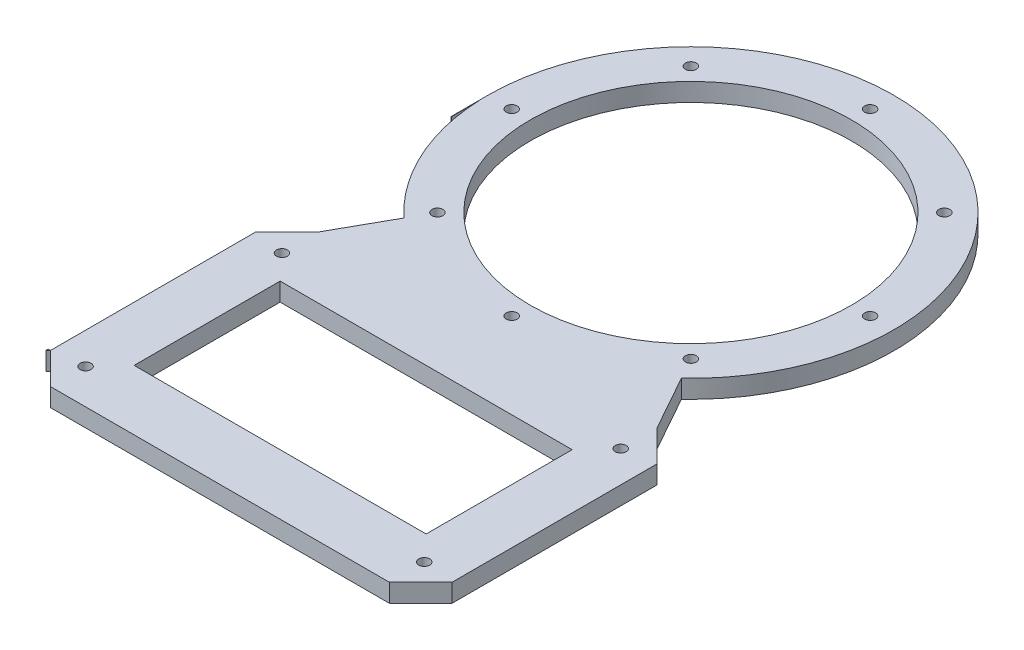
ISO-10303-21;
HEADER;
FILE_DESCRIPTION(('STEP AP214'),'2;1');
FILE_NAME('part.step','',(''),(''),'','','');
FILE_SCHEMA(('AUTOMOTIVE_DESIGN { 1 0 10303 214 1 1 1 1 }'));
ENDSEC;
DATA;
#1=APPLICATION_CONTEXT('core data for automotive mechanical design processes');
#2=APPLICATION_PROTOCOL_DEFINITION('international standard','automotive_design',2000,#1);
#3=PRODUCT_CONTEXT('',#1,'mechanical');
#4=PRODUCT('Part','Part','',(#3));
#5=PRODUCT_RELATED_PRODUCT_CATEGORY('part','',(#4));
#6=PRODUCT_DEFINITION_FORMATION('','',#4);
#7=PRODUCT_DEFINITION_CONTEXT('part definition',#1,'design');
#8=PRODUCT_DEFINITION('design','',#6,#7);
#9=PRODUCT_DEFINITION_SHAPE('','',#8);
#10=(LENGTH_UNIT() NAMED_UNIT(*) SI_UNIT(.MILLI.,.METRE.));
#11=(NAMED_UNIT(*) PLANE_ANGLE_UNIT() SI_UNIT($,.RADIAN.));
#12=(NAMED_UNIT(*) SI_UNIT($,.STERADIAN.) SOLID_ANGLE_UNIT());
#13=UNCERTAINTY_MEASURE_WITH_UNIT(LENGTH_MEASURE(1.E-05),#10,'distance_accuracy_value','');
#14=(GEOMETRIC_REPRESENTATION_CONTEXT(3) GLOBAL_UNCERTAINTY_ASSIGNED_CONTEXT((#13)) GLOBAL_UNIT_ASSIGNED_CONTEXT((#10,
#11,#12)) REPRESENTATION_CONTEXT('',''));
#15=CARTESIAN_POINT('',(0.,0.,0.));
#16=DIRECTION('',(0.,0.,1.));
#17=DIRECTION('',(1.,0.,0.));
#18=AXIS2_PLACEMENT_3D('',#15,#16,#17);
#19=CARTESIAN_POINT('',(0.,5.,0.));
#20=DIRECTION('',(0.,1.,0.));
#21=DIRECTION('',(0.,0.,1.));
#22=AXIS2_PLACEMENT_3D('',#19,#20,#21);
#23=PLANE('',#22);
#24=DIRECTION('',(-1.,0.,0.));
#25=VECTOR('',#24,1.);
#26=CARTESIAN_POINT('',(-55.,5.,10.100208009947));
#27=LINE('',#26,#25);
#28=CARTESIAN_POINT('',(-55.5231153531416,5.,10.100208009947));
#29=VERTEX_POINT('',#28);
#30=CARTESIAN_POINT('',(-55.6267813796967,5.,10.100208009947));
#31=VERTEX_POINT('',#30);
#32=EDGE_CURVE('E286',#29,#31,#27,.T.);
#33=ORIENTED_EDGE('',*,*,#32,.F.);
#34=DIRECTION('',(-0.00966358614296542,0.,-0.999953306461286));
#35=VECTOR('',#34,1.);
#36=CARTESIAN_POINT('',(-55.6155300054044,5.,0.537470561496375));
#37=LINE('',#36,#35);
#38=CARTESIAN_POINT('',(-55.6042786311121,5.,1.70172250269174));
#39=VERTEX_POINT('',#38);
#40=EDGE_CURVE('E300',#29,#39,#37,.T.);
#41=ORIENTED_EDGE('',*,*,#40,.T.);
#42=CARTESIAN_POINT('',(0.,5.,0.));
#43=DIRECTION('',(0.,1.,0.));
#44=DIRECTION('',(0.,0.,1.));
#45=AXIS2_PLACEMENT_3D('',#42,#43,#44);
#46=CIRCLE('',#45,55.6303124345218);
#47=CARTESIAN_POINT('',(-38.0133988234325,5.,40.6166612543814));
#48=VERTEX_POINT('',#47);
#49=EDGE_CURVE('E312',#39,#48,#46,.T.);
#50=ORIENTED_EDGE('',*,*,#49,.T.);
#51=DIRECTION('',(0.487671562378733,0.,-0.873027174403572));
#52=VECTOR('',#51,1.);
#53=CARTESIAN_POINT('',(-11.6803523639078,5.,-6.52462586898569));
#54=LINE('',#53,#52);
#55=CARTESIAN_POINT('',(-46.4,5.,55.6303124345218));
#56=VERTEX_POINT('',#55);
#57=EDGE_CURVE('E373',#56,#48,#54,.T.);
#58=ORIENTED_EDGE('',*,*,#57,.F.);
#59=DIRECTION('',(-0.707106781186541,0.,0.707106781186554));
#60=VECTOR('',#59,1.);
#61=CARTESIAN_POINT('',(4.6151562172605,5.,4.61515621726042));
#62=LINE('',#61,#60);
#63=CARTESIAN_POINT('',(-55.,5.,64.230312434522));
#64=VERTEX_POINT('',#63);
#65=EDGE_CURVE('E315',#56,#64,#62,.T.);
#66=ORIENTED_EDGE('',*,*,#65,.T.);
#67=DIRECTION('',(0.,0.,-1.));
#68=VECTOR('',#67,1.);
#69=CARTESIAN_POINT('',(-55.,5.,120.419438856063));
#70=LINE('',#69,#68);
#71=CARTESIAN_POINT('',(-55.,5.,120.419438856063));
#72=VERTEX_POINT('',#71);
#73=EDGE_CURVE('E169',#72,#64,#70,.T.);
#74=ORIENTED_EDGE('',*,*,#73,.F.);
#75=DIRECTION('',(-0.707106781186551,0.,-0.707106781186544));
#76=VECTOR('',#75,1.);
#77=CARTESIAN_POINT('',(-87.7097194280314,5.,87.7097194280323));
#78=LINE('',#77,#76);
#79=CARTESIAN_POINT('',(-46.4,5.,129.019438856063));
#80=VERTEX_POINT('',#79);
#81=EDGE_CURVE('E333',#80,#72,#78,.T.);
#82=ORIENTED_EDGE('',*,*,#81,.F.);
#83=DIRECTION('',(1.,0.,0.));
#84=VECTOR('',#83,1.);
#85=CARTESIAN_POINT('',(0.,5.,129.019438856063));
#86=LINE('',#85,#84);
#87=CARTESIAN_POINT('',(46.4,5.,129.019438856063));
#88=VERTEX_POINT('',#87);
#89=EDGE_CURVE('E363',#80,#88,#86,.T.);
#90=ORIENTED_EDGE('',*,*,#89,.T.);
#91=DIRECTION('',(0.707106781186546,0.,-0.707106781186549));
#92=VECTOR('',#91,1.);
#93=CARTESIAN_POINT('',(87.7097194280317,5.,87.7097194280314));
#94=LINE('',#93,#92);
#95=CARTESIAN_POINT('',(55.,5.,120.419438856063));
#96=VERTEX_POINT('',#95);
#97=EDGE_CURVE('E344',#88,#96,#94,.T.);
#98=ORIENTED_EDGE('',*,*,#97,.T.);
#99=DIRECTION('',(0.,0.,1.));
#100=VECTOR('',#99,1.);
#101=CARTESIAN_POINT('',(55.,5.,0.));
#102=LINE('',#101,#100);
#103=CARTESIAN_POINT('',(55.,5.,64.2303124345216));
#104=VERTEX_POINT('',#103);
#105=EDGE_CURVE('E356',#104,#96,#102,.T.);
#106=ORIENTED_EDGE('',*,*,#105,.F.);
#107=DIRECTION('',(0.707106781186556,0.,0.707106781186539));
#108=VECTOR('',#107,1.);
#109=CARTESIAN_POINT('',(-4.61515621726145,5.,4.61515621726156));
#110=LINE('',#109,#108);
#111=CARTESIAN_POINT('',(46.4,5.,55.6303124345218));
#112=VERTEX_POINT('',#111);
#113=EDGE_CURVE('E350',#112,#104,#110,.T.);
#114=ORIENTED_EDGE('',*,*,#113,.F.);
#115=DIRECTION('',(-0.48767156237877,0.,-0.873027174403552));
#116=VECTOR('',#115,1.);
#117=CARTESIAN_POINT('',(11.6803523639049,5.,-6.52462586898473));
#118=LINE('',#117,#116);
#119=CARTESIAN_POINT('',(38.013398823432,5.,40.6166612543819));
#120=VERTEX_POINT('',#119);
#121=EDGE_CURVE('E341',#112,#120,#118,.T.);
#122=ORIENTED_EDGE('',*,*,#121,.T.);
#123=CARTESIAN_POINT('',(-55.6267813796967,5.,-0.626781379698214));
#124=VERTEX_POINT('',#123);
#125=EDGE_CURVE('E317',#120,#124,#46,.T.);
#126=ORIENTED_EDGE('',*,*,#125,.T.);
#127=DIRECTION('',(0.,0.,1.));
#128=VECTOR('',#127,1.);
#129=CARTESIAN_POINT('',(-55.6267813796967,5.,0.));
#130=LINE('',#129,#128);
#131=EDGE_CURVE('E303',#124,#31,#130,.T.);
#132=ORIENTED_EDGE('',*,*,#131,.T.);
#133=EDGE_LOOP('',(#33,#41,#50,#58,#66,#74,#82,#90,#98,#106,#114,#122,#126,#132));
#134=FACE_BOUND('',#133,.T.);
#135=DIRECTION('',(0.,0.,-1.));
#136=VECTOR('',#135,1.);
#137=CARTESIAN_POINT('',(-40.,5.,0.));
#138=LINE('',#137,#136);
#139=CARTESIAN_POINT('',(-40.,5.,112.530312434522));
#140=VERTEX_POINT('',#139);
#141=CARTESIAN_POINT('',(-40.,5.,72.5303124345218));
#142=VERTEX_POINT('',#141);
#143=EDGE_CURVE('E335',#140,#142,#138,.T.);
#144=ORIENTED_EDGE('',*,*,#143,.T.);
#145=DIRECTION('',(1.,0.,0.));
#146=VECTOR('',#145,1.);
#147=CARTESIAN_POINT('',(0.,5.,72.5303124345218));
#148=LINE('',#147,#146);
#149=CARTESIAN_POINT('',(40.,5.,72.5303124345218));
#150=VERTEX_POINT('',#149);
#151=EDGE_CURVE('E339',#142,#150,#148,.T.);
#152=ORIENTED_EDGE('',*,*,#151,.T.);
#153=DIRECTION('',(0.,0.,1.));
#154=VECTOR('',#153,1.);
#155=CARTESIAN_POINT('',(40.,5.,0.));
#156=LINE('',#155,#154);
#157=CARTESIAN_POINT('',(40.,5.,112.530312434522));
#158=VERTEX_POINT('',#157);
#159=EDGE_CURVE('E457',#150,#158,#156,.T.);
#160=ORIENTED_EDGE('',*,*,#159,.T.);
#161=DIRECTION('',(-1.,0.,0.));
#162=VECTOR('',#161,1.);
#163=CARTESIAN_POINT('',(0.,5.,112.530312434522));
#164=LINE('',#163,#162);
#165=EDGE_CURVE('E454',#158,#140,#164,.T.);
#166=ORIENTED_EDGE('',*,*,#165,.T.);
#167=EDGE_LOOP('',(#144,#152,#160,#166));
#168=FACE_BOUND('',#167,.T.);
#169=CARTESIAN_POINT('',(46.4,5.,65.6303124345218));
#170=DIRECTION('',(0.,1.,0.));
#171=DIRECTION('',(0.,0.,1.));
#172=AXIS2_PLACEMENT_3D('',#169,#170,#171);
#173=CIRCLE('',#172,1.5);
#174=CARTESIAN_POINT('',(46.4,5.,67.1303124345218));
#175=VERTEX_POINT('',#174);
#176=EDGE_CURVE('E462',#175,#175,#173,.T.);
#177=ORIENTED_EDGE('',*,*,#176,.F.);
#178=EDGE_LOOP('',(#177));
#179=FACE_BOUND('',#178,.T.);
#180=CARTESIAN_POINT('',(0.,5.,0.));
#181=DIRECTION('',(0.,1.,0.));
#182=DIRECTION('',(0.,0.,1.));
#183=AXIS2_PLACEMENT_3D('',#180,#181,#182);
#184=CIRCLE('',#183,44.);
#185=CARTESIAN_POINT('',(0.,5.,44.));
#186=VERTEX_POINT('',#185);
#187=EDGE_CURVE('E466',#186,#186,#184,.T.);
#188=ORIENTED_EDGE('',*,*,#187,.F.);
#189=EDGE_LOOP('',(#188));
#190=FACE_BOUND('',#189,.T.);
#191=CARTESIAN_POINT('',(-49.1,5.,0.));
#192=DIRECTION('',(0.,1.,0.));
#193=DIRECTION('',(0.,0.,1.));
#194=AXIS2_PLACEMENT_3D('',#191,#192,#193);
#195=CIRCLE('',#194,1.5);
#196=CARTESIAN_POINT('',(-49.1,5.,1.5));
#197=VERTEX_POINT('',#196);
#198=EDGE_CURVE('E471',#197,#197,#195,.T.);
#199=ORIENTED_EDGE('',*,*,#198,.F.);
#200=EDGE_LOOP('',(#199));
#201=FACE_BOUND('',#200,.T.);
#202=CARTESIAN_POINT('',(-34.7189429562594,5.,-34.7189429562595));
#203=DIRECTION('',(0.,1.,0.));
#204=DIRECTION('',(0.,0.,1.));
#205=AXIS2_PLACEMENT_3D('',#202,#203,#204);
#206=CIRCLE('',#205,1.50000000000001);
#207=CARTESIAN_POINT('',(-34.7189429562594,5.,-33.2189429562595));
#208=VERTEX_POINT('',#207);
#209=EDGE_CURVE('E475',#208,#208,#206,.T.);
#210=ORIENTED_EDGE('',*,*,#209,.F.);
#211=EDGE_LOOP('',(#210));
#212=FACE_BOUND('',#211,.T.);
#213=CARTESIAN_POINT('',(1.71431733737198E-13,5.,-49.1));
#214=DIRECTION('',(0.,1.,0.));
#215=DIRECTION('',(0.,0.,1.));
#216=AXIS2_PLACEMENT_3D('',#213,#214,#215);
#217=CIRCLE('',#216,1.5);
#218=CARTESIAN_POINT('',(1.71431733737198E-13,5.,-47.6));
#219=VERTEX_POINT('',#218);
#220=EDGE_CURVE('E479',#219,#219,#217,.T.);
#221=ORIENTED_EDGE('',*,*,#220,.F.);
#222=EDGE_LOOP('',(#221));
#223=FACE_BOUND('',#222,.T.);
#224=CARTESIAN_POINT('',(34.7189429562597,5.,-34.7189429562593));
#225=DIRECTION('',(0.,1.,0.));
#226=DIRECTION('',(0.,0.,1.));
#227=AXIS2_PLACEMENT_3D('',#224,#225,#226);
#228=CIRCLE('',#227,1.50000000000001);
#229=CARTESIAN_POINT('',(34.7189429562597,5.,-33.2189429562593));
#230=VERTEX_POINT('',#229);
#231=EDGE_CURVE('E483',#230,#230,#228,.T.);
#232=ORIENTED_EDGE('',*,*,#231,.F.);
#233=EDGE_LOOP('',(#232));
#234=FACE_BOUND('',#233,.T.);
#235=CARTESIAN_POINT('',(49.1,5.,3.42863467474396E-13));
#236=DIRECTION('',(0.,1.,0.));
#237=DIRECTION('',(0.,0.,1.));
#238=AXIS2_PLACEMENT_3D('',#235,#236,#237);
#239=CIRCLE('',#238,1.5);
#240=CARTESIAN_POINT('',(49.1,5.,1.50000000000034));
#241=VERTEX_POINT('',#240);
#242=EDGE_CURVE('E487',#241,#241,#239,.T.);
#243=ORIENTED_EDGE('',*,*,#242,.F.);
#244=EDGE_LOOP('',(#243));
#245=FACE_BOUND('',#244,.T.);
#246=CARTESIAN_POINT('',(34.7189429562592,5.,34.7189429562598));
#247=DIRECTION('',(0.,1.,0.));
#248=DIRECTION('',(0.,0.,1.));
#249=AXIS2_PLACEMENT_3D('',#246,#247,#248);
#250=CIRCLE('',#249,1.50000000000001);
#251=CARTESIAN_POINT('',(34.7189429562592,5.,36.2189429562598));
#252=VERTEX_POINT('',#251);
#253=EDGE_CURVE('E491',#252,#252,#250,.T.);
#254=ORIENTED_EDGE('',*,*,#253,.F.);
#255=EDGE_LOOP('',(#254));
#256=FACE_BOUND('',#255,.T.);
#257=CARTESIAN_POINT('',(-5.14295201211594E-13,5.,49.1));
#258=DIRECTION('',(0.,1.,0.));
#259=DIRECTION('',(0.,0.,1.));
#260=AXIS2_PLACEMENT_3D('',#257,#258,#259);
#261=CIRCLE('',#260,1.50000000000001);
#262=CARTESIAN_POINT('',(-5.14295201211594E-13,5.,50.6));
#263=VERTEX_POINT('',#262);
#264=EDGE_CURVE('E419',#263,#263,#261,.T.);
#265=ORIENTED_EDGE('',*,*,#264,.F.);
#266=EDGE_LOOP('',(#265));
#267=FACE_BOUND('',#266,.T.);
#268=CARTESIAN_POINT('',(-34.7189429562599,5.,34.7189429562591));
#269=DIRECTION('',(0.,1.,0.));
#270=DIRECTION('',(0.,0.,1.));
#271=AXIS2_PLACEMENT_3D('',#268,#269,#270);
#272=CIRCLE('',#271,1.5);
#273=CARTESIAN_POINT('',(-34.7189429562599,5.,36.218942956259));
#274=VERTEX_POINT('',#273);
#275=EDGE_CURVE('E347',#274,#274,#272,.T.);
#276=ORIENTED_EDGE('',*,*,#275,.F.);
#277=EDGE_LOOP('',(#276));
#278=FACE_BOUND('',#277,.T.);
#279=CARTESIAN_POINT('',(-46.4,5.,65.6303124345218));
#280=DIRECTION('',(0.,1.,0.));
#281=DIRECTION('',(0.,0.,1.));
#282=AXIS2_PLACEMENT_3D('',#279,#280,#281);
#283=CIRCLE('',#282,1.5);
#284=CARTESIAN_POINT('',(-46.4,5.,67.1303124345218));
#285=VERTEX_POINT('',#284);
#286=EDGE_CURVE('E379',#285,#285,#283,.T.);
#287=ORIENTED_EDGE('',*,*,#286,.F.);
#288=EDGE_LOOP('',(#287));
#289=FACE_BOUND('',#288,.T.);
#290=CARTESIAN_POINT('',(-46.4,5.,119.430312434522));
#291=DIRECTION('',(0.,1.,0.));
#292=DIRECTION('',(0.,0.,1.));
#293=AXIS2_PLACEMENT_3D('',#290,#291,#292);
#294=CIRCLE('',#293,1.5);
#295=CARTESIAN_POINT('',(-46.4,5.,120.930312434522));
#296=VERTEX_POINT('',#295);
#297=EDGE_CURVE('E383',#296,#296,#294,.T.);
#298=ORIENTED_EDGE('',*,*,#297,.F.);
#299=EDGE_LOOP('',(#298));
#300=FACE_BOUND('',#299,.T.);
#301=CARTESIAN_POINT('',(46.4,5.,119.430312434522));
#302=DIRECTION('',(0.,1.,0.));
#303=DIRECTION('',(0.,0.,1.));
#304=AXIS2_PLACEMENT_3D('',#301,#302,#303);
#305=CIRCLE('',#304,1.5);
#306=CARTESIAN_POINT('',(46.4,5.,120.930312434522));
#307=VERTEX_POINT('',#306);
#308=EDGE_CURVE('E388',#307,#307,#305,.T.);
#309=ORIENTED_EDGE('',*,*,#308,.F.);
#310=EDGE_LOOP('',(#309));
#311=FACE_BOUND('',#310,.T.);
#312=ADVANCED_FACE('F159',(#134,#168,#179,#190,#201,#212,#223,#234,#245,#256,#267,#278,#289,
#300,#311),#23,.T.);
#313=CARTESIAN_POINT('',(0.,0.,0.));
#314=DIRECTION('',(0.,1.,0.));
#315=DIRECTION('',(0.,0.,1.));
#316=AXIS2_PLACEMENT_3D('',#313,#314,#315);
#317=PLANE('',#316);
#318=CARTESIAN_POINT('',(46.4,0.,119.430312434522));
#319=DIRECTION('',(0.,1.,0.));
#320=DIRECTION('',(0.,0.,1.));
#321=AXIS2_PLACEMENT_3D('',#318,#319,#320);
#322=CIRCLE('',#321,1.5);
#323=CARTESIAN_POINT('',(46.4,0.,120.930312434522));
#324=VERTEX_POINT('',#323);
#325=EDGE_CURVE('E450',#324,#324,#322,.T.);
#326=ORIENTED_EDGE('',*,*,#325,.T.);
#327=EDGE_LOOP('',(#326));
#328=FACE_BOUND('',#327,.T.);
#329=CARTESIAN_POINT('',(-46.4,0.,119.430312434522));
#330=DIRECTION('',(0.,1.,0.));
#331=DIRECTION('',(0.,0.,1.));
#332=AXIS2_PLACEMENT_3D('',#329,#330,#331);
#333=CIRCLE('',#332,1.5);
#334=CARTESIAN_POINT('',(-46.4,0.,120.930312434522));
#335=VERTEX_POINT('',#334);
#336=EDGE_CURVE('E446',#335,#335,#333,.T.);
#337=ORIENTED_EDGE('',*,*,#336,.T.);
#338=EDGE_LOOP('',(#337));
#339=FACE_BOUND('',#338,.T.);
#340=CARTESIAN_POINT('',(-46.4,0.,65.6303124345218));
#341=DIRECTION('',(0.,1.,0.));
#342=DIRECTION('',(0.,0.,1.));
#343=AXIS2_PLACEMENT_3D('',#340,#341,#342);
#344=CIRCLE('',#343,1.5);
#345=CARTESIAN_POINT('',(-46.4,0.,67.1303124345218));
#346=VERTEX_POINT('',#345);
#347=EDGE_CURVE('E441',#346,#346,#344,.T.);
#348=ORIENTED_EDGE('',*,*,#347,.T.);
#349=EDGE_LOOP('',(#348));
#350=FACE_BOUND('',#349,.T.);
#351=CARTESIAN_POINT('',(-34.7189429562599,0.,34.7189429562591));
#352=DIRECTION('',(0.,1.,0.));
#353=DIRECTION('',(0.,0.,1.));
#354=AXIS2_PLACEMENT_3D('',#351,#352,#353);
#355=CIRCLE('',#354,1.5);
#356=CARTESIAN_POINT('',(-34.7189429562599,0.,36.218942956259));
#357=VERTEX_POINT('',#356);
#358=EDGE_CURVE('E445',#357,#357,#355,.T.);
#359=ORIENTED_EDGE('',*,*,#358,.T.);
#360=EDGE_LOOP('',(#359));
#361=FACE_BOUND('',#360,.T.);
#362=CARTESIAN_POINT('',(-5.14295201211594E-13,0.,49.1));
#363=DIRECTION('',(0.,1.,0.));
#364=DIRECTION('',(0.,0.,1.));
#365=AXIS2_PLACEMENT_3D('',#362,#363,#364);
#366=CIRCLE('',#365,1.50000000000001);
#367=CARTESIAN_POINT('',(-5.14295201211594E-13,0.,50.6));
#368=VERTEX_POINT('',#367);
#369=EDGE_CURVE('E532',#368,#368,#366,.T.);
#370=ORIENTED_EDGE('',*,*,#369,.T.);
#371=EDGE_LOOP('',(#370));
#372=FACE_BOUND('',#371,.T.);
#373=CARTESIAN_POINT('',(34.7189429562592,0.,34.7189429562598));
#374=DIRECTION('',(0.,1.,0.));
#375=DIRECTION('',(0.,0.,1.));
#376=AXIS2_PLACEMENT_3D('',#373,#374,#375);
#377=CIRCLE('',#376,1.50000000000001);
#378=CARTESIAN_POINT('',(34.7189429562592,0.,36.2189429562598));
#379=VERTEX_POINT('',#378);
#380=EDGE_CURVE('E536',#379,#379,#377,.T.);
#381=ORIENTED_EDGE('',*,*,#380,.T.);
#382=EDGE_LOOP('',(#381));
#383=FACE_BOUND('',#382,.T.);
#384=CARTESIAN_POINT('',(49.1,0.,3.42863467474396E-13));
#385=DIRECTION('',(0.,1.,0.));
#386=DIRECTION('',(0.,0.,1.));
#387=AXIS2_PLACEMENT_3D('',#384,#385,#386);
#388=CIRCLE('',#387,1.5);
#389=CARTESIAN_POINT('',(49.1,0.,1.50000000000034));
#390=VERTEX_POINT('',#389);
#391=EDGE_CURVE('E540',#390,#390,#388,.T.);
#392=ORIENTED_EDGE('',*,*,#391,.T.);
#393=EDGE_LOOP('',(#392));
#394=FACE_BOUND('',#393,.T.);
#395=CARTESIAN_POINT('',(34.7189429562597,0.,-34.7189429562593));
#396=DIRECTION('',(0.,1.,0.));
#397=DIRECTION('',(0.,0.,1.));
#398=AXIS2_PLACEMENT_3D('',#395,#396,#397);
#399=CIRCLE('',#398,1.50000000000001);
#400=CARTESIAN_POINT('',(34.7189429562597,0.,-33.2189429562593));
#401=VERTEX_POINT('',#400);
#402=EDGE_CURVE('E544',#401,#401,#399,.T.);
#403=ORIENTED_EDGE('',*,*,#402,.T.);
#404=EDGE_LOOP('',(#403));
#405=FACE_BOUND('',#404,.T.);
#406=CARTESIAN_POINT('',(1.71431733737198E-13,0.,-49.1));
#407=DIRECTION('',(0.,1.,0.));
#408=DIRECTION('',(0.,0.,1.));
#409=AXIS2_PLACEMENT_3D('',#406,#407,#408);
#410=CIRCLE('',#409,1.5);
#411=CARTESIAN_POINT('',(1.71431733737198E-13,0.,-47.6));
#412=VERTEX_POINT('',#411);
#413=EDGE_CURVE('E548',#412,#412,#410,.T.);
#414=ORIENTED_EDGE('',*,*,#413,.T.);
#415=EDGE_LOOP('',(#414));
#416=FACE_BOUND('',#415,.T.);
#417=CARTESIAN_POINT('',(-34.7189429562594,0.,-34.7189429562595));
#418=DIRECTION('',(0.,1.,0.));
#419=DIRECTION('',(0.,0.,1.));
#420=AXIS2_PLACEMENT_3D('',#417,#418,#419);
#421=CIRCLE('',#420,1.50000000000001);
#422=CARTESIAN_POINT('',(-34.7189429562594,0.,-33.2189429562595));
#423=VERTEX_POINT('',#422);
#424=EDGE_CURVE('E552',#423,#423,#421,.T.);
#425=ORIENTED_EDGE('',*,*,#424,.T.);
#426=EDGE_LOOP('',(#425));
#427=FACE_BOUND('',#426,.T.);
#428=CARTESIAN_POINT('',(-49.1,0.,0.));
#429=DIRECTION('',(0.,1.,0.));
#430=DIRECTION('',(0.,0.,1.));
#431=AXIS2_PLACEMENT_3D('',#428,#429,#430);
#432=CIRCLE('',#431,1.5);
#433=CARTESIAN_POINT('',(-49.1,0.,1.5));
#434=VERTEX_POINT('',#433);
#435=EDGE_CURVE('E556',#434,#434,#432,.T.);
#436=ORIENTED_EDGE('',*,*,#435,.T.);
#437=EDGE_LOOP('',(#436));
#438=FACE_BOUND('',#437,.T.);
#439=CARTESIAN_POINT('',(0.,0.,0.));
#440=DIRECTION('',(0.,1.,0.));
#441=DIRECTION('',(0.,0.,1.));
#442=AXIS2_PLACEMENT_3D('',#439,#440,#441);
#443=CIRCLE('',#442,44.);
#444=CARTESIAN_POINT('',(0.,0.,44.));
#445=VERTEX_POINT('',#444);
#446=EDGE_CURVE('E560',#445,#445,#443,.T.);
#447=ORIENTED_EDGE('',*,*,#446,.T.);
#448=EDGE_LOOP('',(#447));
#449=FACE_BOUND('',#448,.T.);
#450=CARTESIAN_POINT('',(46.4,0.,65.6303124345218));
#451=DIRECTION('',(0.,1.,0.));
#452=DIRECTION('',(0.,0.,1.));
#453=AXIS2_PLACEMENT_3D('',#450,#451,#452);
#454=CIRCLE('',#453,1.5);
#455=CARTESIAN_POINT('',(46.4,0.,67.1303124345218));
#456=VERTEX_POINT('',#455);
#457=EDGE_CURVE('E328',#456,#456,#454,.T.);
#458=ORIENTED_EDGE('',*,*,#457,.T.);
#459=EDGE_LOOP('',(#458));
#460=FACE_BOUND('',#459,.T.);
#461=DIRECTION('',(0.,0.,-1.));
#462=VECTOR('',#461,1.);
#463=CARTESIAN_POINT('',(-40.,0.,0.));
#464=LINE('',#463,#462);
#465=CARTESIAN_POINT('',(-40.,0.,112.530312434522));
#466=VERTEX_POINT('',#465);
#467=CARTESIAN_POINT('',(-40.,0.,72.5303124345218));
#468=VERTEX_POINT('',#467);
#469=EDGE_CURVE('E423',#466,#468,#464,.T.);
#470=ORIENTED_EDGE('',*,*,#469,.F.);
#471=DIRECTION('',(-1.,0.,0.));
#472=VECTOR('',#471,1.);
#473=CARTESIAN_POINT('',(0.,0.,112.530312434522));
#474=LINE('',#473,#472);
#475=CARTESIAN_POINT('',(40.,0.,112.530312434522));
#476=VERTEX_POINT('',#475);
#477=EDGE_CURVE('E392',#476,#466,#474,.T.);
#478=ORIENTED_EDGE('',*,*,#477,.F.);
#479=DIRECTION('',(0.,0.,1.));
#480=VECTOR('',#479,1.);
#481=CARTESIAN_POINT('',(40.,0.,0.));
#482=LINE('',#481,#480);
#483=CARTESIAN_POINT('',(40.,0.,72.5303124345218));
#484=VERTEX_POINT('',#483);
#485=EDGE_CURVE('E587',#484,#476,#482,.T.);
#486=ORIENTED_EDGE('',*,*,#485,.F.);
#487=DIRECTION('',(1.,0.,0.));
#488=VECTOR('',#487,1.);
#489=CARTESIAN_POINT('',(0.,0.,72.5303124345218));
#490=LINE('',#489,#488);
#491=EDGE_CURVE('E567',#468,#484,#490,.T.);
#492=ORIENTED_EDGE('',*,*,#491,.F.);
#493=EDGE_LOOP('',(#470,#478,#486,#492));
#494=FACE_BOUND('',#493,.T.);
#495=DIRECTION('',(-0.00966358614296542,0.,-0.999953306461286));
#496=VECTOR('',#495,1.);
#497=CARTESIAN_POINT('',(-55.6155300054044,0.,0.537470561496375));
#498=LINE('',#497,#496);
#499=CARTESIAN_POINT('',(-55.5231153531416,0.,10.100208009947));
#500=VERTEX_POINT('',#499);
#501=CARTESIAN_POINT('',(-55.6042786311121,0.,1.70172250269174));
#502=VERTEX_POINT('',#501);
#503=EDGE_CURVE('E294',#500,#502,#498,.T.);
#504=ORIENTED_EDGE('',*,*,#503,.F.);
#505=DIRECTION('',(-1.,0.,0.));
#506=VECTOR('',#505,1.);
#507=CARTESIAN_POINT('',(0.,0.,10.100208009947));
#508=LINE('',#507,#506);
#509=CARTESIAN_POINT('',(-55.6267813796967,0.,10.100208009947));
#510=VERTEX_POINT('',#509);
#511=EDGE_CURVE('E289',#500,#510,#508,.T.);
#512=ORIENTED_EDGE('',*,*,#511,.T.);
#513=DIRECTION('',(0.,0.,1.));
#514=VECTOR('',#513,1.);
#515=CARTESIAN_POINT('',(-55.6267813796967,0.,0.));
#516=LINE('',#515,#514);
#517=CARTESIAN_POINT('',(-55.6267813796967,0.,-0.626781379698214));
#518=VERTEX_POINT('',#517);
#519=EDGE_CURVE('E162',#518,#510,#516,.T.);
#520=ORIENTED_EDGE('',*,*,#519,.F.);
#521=CARTESIAN_POINT('',(0.,0.,0.));
#522=DIRECTION('',(0.,1.,0.));
#523=DIRECTION('',(0.,0.,1.));
#524=AXIS2_PLACEMENT_3D('',#521,#522,#523);
#525=CIRCLE('',#524,55.6303124345218);
#526=CARTESIAN_POINT('',(38.013398823432,0.,40.6166612543819));
#527=VERTEX_POINT('',#526);
#528=EDGE_CURVE('E406',#527,#518,#525,.T.);
#529=ORIENTED_EDGE('',*,*,#528,.F.);
#530=DIRECTION('',(-0.48767156237877,0.,-0.873027174403552));
#531=VECTOR('',#530,1.);
#532=CARTESIAN_POINT('',(11.6803523639049,0.,-6.52462586898473));
#533=LINE('',#532,#531);
#534=CARTESIAN_POINT('',(46.4,0.,55.6303124345218));
#535=VERTEX_POINT('',#534);
#536=EDGE_CURVE('E626',#535,#527,#533,.T.);
#537=ORIENTED_EDGE('',*,*,#536,.F.);
#538=DIRECTION('',(0.707106781186556,0.,0.707106781186539));
#539=VECTOR('',#538,1.);
#540=CARTESIAN_POINT('',(-4.61515621726145,0.,4.61515621726156));
#541=LINE('',#540,#539);
#542=CARTESIAN_POINT('',(55.,0.,64.2303124345216));
#543=VERTEX_POINT('',#542);
#544=EDGE_CURVE('E327',#535,#543,#541,.T.);
#545=ORIENTED_EDGE('',*,*,#544,.T.);
#546=DIRECTION('',(0.,0.,1.));
#547=VECTOR('',#546,1.);
#548=CARTESIAN_POINT('',(55.,0.,0.));
#549=LINE('',#548,#547);
#550=CARTESIAN_POINT('',(55.,0.,120.419438856063));
#551=VERTEX_POINT('',#550);
#552=EDGE_CURVE('E611',#543,#551,#549,.T.);
#553=ORIENTED_EDGE('',*,*,#552,.T.);
#554=DIRECTION('',(0.707106781186546,0.,-0.707106781186549));
#555=VECTOR('',#554,1.);
#556=CARTESIAN_POINT('',(87.7097194280317,0.,87.7097194280314));
#557=LINE('',#556,#555);
#558=CARTESIAN_POINT('',(46.4,0.,129.019438856063));
#559=VERTEX_POINT('',#558);
#560=EDGE_CURVE('E623',#559,#551,#557,.T.);
#561=ORIENTED_EDGE('',*,*,#560,.F.);
#562=DIRECTION('',(1.,0.,0.));
#563=VECTOR('',#562,1.);
#564=CARTESIAN_POINT('',(0.,0.,129.019438856063));
#565=LINE('',#564,#563);
#566=CARTESIAN_POINT('',(-46.4,0.,129.019438856063));
#567=VERTEX_POINT('',#566);
#568=EDGE_CURVE('E332',#567,#559,#565,.T.);
#569=ORIENTED_EDGE('',*,*,#568,.F.);
#570=DIRECTION('',(-0.707106781186551,0.,-0.707106781186544));
#571=VECTOR('',#570,1.);
#572=CARTESIAN_POINT('',(-87.7097194280314,0.,87.7097194280323));
#573=LINE('',#572,#571);
#574=CARTESIAN_POINT('',(-55.,0.,120.419438856063));
#575=VERTEX_POINT('',#574);
#576=EDGE_CURVE('E323',#567,#575,#573,.T.);
#577=ORIENTED_EDGE('',*,*,#576,.T.);
#578=DIRECTION('',(0.,0.,-1.));
#579=VECTOR('',#578,1.);
#580=CARTESIAN_POINT('',(-55.,0.,0.));
#581=LINE('',#580,#579);
#582=CARTESIAN_POINT('',(-55.,0.,64.230312434522));
#583=VERTEX_POINT('',#582);
#584=EDGE_CURVE('E176',#575,#583,#581,.T.);
#585=ORIENTED_EDGE('',*,*,#584,.T.);
#586=DIRECTION('',(-0.707106781186541,0.,0.707106781186554));
#587=VECTOR('',#586,1.);
#588=CARTESIAN_POINT('',(4.6151562172605,0.,4.61515621726042));
#589=LINE('',#588,#587);
#590=CARTESIAN_POINT('',(-46.4,0.,55.6303124345218));
#591=VERTEX_POINT('',#590);
#592=EDGE_CURVE('E439',#591,#583,#589,.T.);
#593=ORIENTED_EDGE('',*,*,#592,.F.);
#594=DIRECTION('',(0.487671562378733,0.,-0.873027174403572));
#595=VECTOR('',#594,1.);
#596=CARTESIAN_POINT('',(-11.6803523639078,0.,-6.52462586898569));
#597=LINE('',#596,#595);
#598=CARTESIAN_POINT('',(-38.0133988234325,0.,40.6166612543814));
#599=VERTEX_POINT('',#598);
#600=EDGE_CURVE('E322',#591,#599,#597,.T.);
#601=ORIENTED_EDGE('',*,*,#600,.T.);
#602=EDGE_CURVE('E414',#502,#599,#525,.T.);
#603=ORIENTED_EDGE('',*,*,#602,.F.);
#604=EDGE_LOOP('',(#504,#512,#520,#529,#537,#545,#553,#561,#569,#577,#585,#593,#601,#603));
#605=FACE_BOUND('',#604,.T.);
#606=ADVANCED_FACE('F404',(#328,#339,#350,#361,#372,#383,#394,#405,#416,#427,#438,#449,#460,
#494,#605),#317,.F.);
#607=CARTESIAN_POINT('',(0.,5.,0.));
#608=DIRECTION('',(0.,-1.,0.));
#609=DIRECTION('',(0.,0.,-1.));
#610=AXIS2_PLACEMENT_3D('',#607,#608,#609);
#611=CYLINDRICAL_SURFACE('',#610,55.6303124345218);
#612=DIRECTION('',(0.,-1.,0.));
#613=VECTOR('',#612,1.);
#614=CARTESIAN_POINT('',(-55.6042786311121,5.,1.70172250269099));
#615=LINE('',#614,#613);
#616=EDGE_CURVE('E309',#502,#39,#615,.F.);
#617=ORIENTED_EDGE('',*,*,#616,.F.);
#618=ORIENTED_EDGE('',*,*,#602,.T.);
#619=DIRECTION('',(0.,-1.,0.));
#620=VECTOR('',#619,1.);
#621=CARTESIAN_POINT('',(-38.0133988234325,5.,40.6166612543814));
#622=LINE('',#621,#620);
#623=EDGE_CURVE('E377',#48,#599,#622,.T.);
#624=ORIENTED_EDGE('',*,*,#623,.F.);
#625=ORIENTED_EDGE('',*,*,#49,.F.);
#626=EDGE_LOOP('',(#617,#618,#624,#625));
#627=FACE_BOUND('',#626,.T.);
#628=ADVANCED_FACE('F521',(#627),#611,.T.);
#629=CARTESIAN_POINT('',(-40.,5.,0.));
#630=DIRECTION('',(-1.,0.,0.));
#631=DIRECTION('',(0.,0.,1.));
#632=AXIS2_PLACEMENT_3D('',#629,#630,#631);
#633=PLANE('',#632);
#634=ORIENTED_EDGE('',*,*,#469,.T.);
#635=DIRECTION('',(0.,-1.,0.));
#636=VECTOR('',#635,1.);
#637=CARTESIAN_POINT('',(-40.,5.,72.5303124345218));
#638=LINE('',#637,#636);
#639=EDGE_CURVE('E574',#142,#468,#638,.T.);
#640=ORIENTED_EDGE('',*,*,#639,.F.);
#641=ORIENTED_EDGE('',*,*,#143,.F.);
#642=DIRECTION('',(0.,-1.,0.));
#643=VECTOR('',#642,1.);
#644=CARTESIAN_POINT('',(-40.,5.,112.530312434522));
#645=LINE('',#644,#643);
#646=EDGE_CURVE('E431',#140,#466,#645,.T.);
#647=ORIENTED_EDGE('',*,*,#646,.T.);
#648=EDGE_LOOP('',(#634,#640,#641,#647));
#649=FACE_BOUND('',#648,.T.);
#650=ADVANCED_FACE('F572',(#649),#633,.F.);
#651=CARTESIAN_POINT('',(0.,5.,72.5303124345218));
#652=DIRECTION('',(0.,0.,-1.));
#653=DIRECTION('',(-1.,0.,0.));
#654=AXIS2_PLACEMENT_3D('',#651,#652,#653);
#655=PLANE('',#654);
#656=ORIENTED_EDGE('',*,*,#491,.T.);
#657=DIRECTION('',(0.,-1.,0.));
#658=VECTOR('',#657,1.);
#659=CARTESIAN_POINT('',(40.,5.,72.5303124345218));
#660=LINE('',#659,#658);
#661=EDGE_CURVE('E378',#150,#484,#660,.T.);
#662=ORIENTED_EDGE('',*,*,#661,.F.);
#663=ORIENTED_EDGE('',*,*,#151,.F.);
#664=ORIENTED_EDGE('',*,*,#639,.T.);
#665=EDGE_LOOP('',(#656,#662,#663,#664));
#666=FACE_BOUND('',#665,.T.);
#667=ADVANCED_FACE('F651',(#666),#655,.F.);
#668=CARTESIAN_POINT('',(40.,5.,0.));
#669=DIRECTION('',(1.,0.,0.));
#670=DIRECTION('',(0.,0.,-1.));
#671=AXIS2_PLACEMENT_3D('',#668,#669,#670);
#672=PLANE('',#671);
#673=ORIENTED_EDGE('',*,*,#485,.T.);
#674=DIRECTION('',(0.,-1.,0.));
#675=VECTOR('',#674,1.);
#676=CARTESIAN_POINT('',(40.,5.,112.530312434522));
#677=LINE('',#676,#675);
#678=EDGE_CURVE('E295',#158,#476,#677,.T.);
#679=ORIENTED_EDGE('',*,*,#678,.F.);
#680=ORIENTED_EDGE('',*,*,#159,.F.);
#681=ORIENTED_EDGE('',*,*,#661,.T.);
#682=EDGE_LOOP('',(#673,#679,#680,#681));
#683=FACE_BOUND('',#682,.T.);
#684=ADVANCED_FACE('F647',(#683),#672,.F.);
#685=CARTESIAN_POINT('',(-11.6803523639078,5.,-6.52462586898569));
#686=DIRECTION('',(-0.873027174403572,0.,-0.487671562378733));
#687=DIRECTION('',(-0.487671562378733,0.,0.873027174403572));
#688=AXIS2_PLACEMENT_3D('',#685,#686,#687);
#689=PLANE('',#688);
#690=ORIENTED_EDGE('',*,*,#600,.F.);
#691=DIRECTION('',(0.,-1.,0.));
#692=VECTOR('',#691,1.);
#693=CARTESIAN_POINT('',(-46.4,5.,55.6303124345218));
#694=LINE('',#693,#692);
#695=EDGE_CURVE('E369',#56,#591,#694,.T.);
#696=ORIENTED_EDGE('',*,*,#695,.F.);
#697=ORIENTED_EDGE('',*,*,#57,.T.);
#698=ORIENTED_EDGE('',*,*,#623,.T.);
#699=EDGE_LOOP('',(#690,#696,#697,#698));
#700=FACE_BOUND('',#699,.T.);
#701=ADVANCED_FACE('F660',(#700),#689,.T.);
#702=CARTESIAN_POINT('',(4.6151562172605,5.,4.61515621726042));
#703=DIRECTION('',(0.707106781186554,0.,0.707106781186541));
#704=DIRECTION('',(0.707106781186541,0.,-0.707106781186554));
#705=AXIS2_PLACEMENT_3D('',#702,#703,#704);
#706=PLANE('',#705);
#707=ORIENTED_EDGE('',*,*,#592,.T.);
#708=DIRECTION('',(0.,-1.,0.));
#709=VECTOR('',#708,1.);
#710=CARTESIAN_POINT('',(-55.,5.,64.230312434522));
#711=LINE('',#710,#709);
#712=EDGE_CURVE('E13',#64,#583,#711,.T.);
#713=ORIENTED_EDGE('',*,*,#712,.F.);
#714=ORIENTED_EDGE('',*,*,#65,.F.);
#715=ORIENTED_EDGE('',*,*,#695,.T.);
#716=EDGE_LOOP('',(#707,#713,#714,#715));
#717=FACE_BOUND('',#716,.T.);
#718=ADVANCED_FACE('F665',(#717),#706,.F.);
#719=CARTESIAN_POINT('',(-87.7097194280314,5.,87.7097194280323));
#720=DIRECTION('',(-0.707106781186544,0.,0.707106781186551));
#721=DIRECTION('',(0.707106781186551,0.,0.707106781186544));
#722=AXIS2_PLACEMENT_3D('',#719,#720,#721);
#723=PLANE('',#722);
#724=ORIENTED_EDGE('',*,*,#576,.F.);
#725=DIRECTION('',(0.,-1.,0.));
#726=VECTOR('',#725,1.);
#727=CARTESIAN_POINT('',(-46.4,5.,129.019438856063));
#728=LINE('',#727,#726);
#729=EDGE_CURVE('E622',#80,#567,#728,.T.);
#730=ORIENTED_EDGE('',*,*,#729,.F.);
#731=ORIENTED_EDGE('',*,*,#81,.T.);
#732=DIRECTION('',(0.,-1.,0.));
#733=VECTOR('',#732,1.);
#734=CARTESIAN_POINT('',(-55.,5.,120.419438856063));
#735=LINE('',#734,#733);
#736=EDGE_CURVE('E278',#72,#575,#735,.T.);
#737=ORIENTED_EDGE('',*,*,#736,.T.);
#738=EDGE_LOOP('',(#724,#730,#731,#737));
#739=FACE_BOUND('',#738,.T.);
#740=ADVANCED_FACE('F689',(#739),#723,.T.);
#741=CARTESIAN_POINT('',(0.,5.,129.019438856063));
#742=DIRECTION('',(0.,0.,-1.));
#743=DIRECTION('',(-1.,0.,0.));
#744=AXIS2_PLACEMENT_3D('',#741,#742,#743);
#745=PLANE('',#744);
#746=ORIENTED_EDGE('',*,*,#568,.T.);
#747=DIRECTION('',(0.,-1.,0.));
#748=VECTOR('',#747,1.);
#749=CARTESIAN_POINT('',(46.4,5.,129.019438856063));
#750=LINE('',#749,#748);
#751=EDGE_CURVE('E360',#88,#559,#750,.T.);
#752=ORIENTED_EDGE('',*,*,#751,.F.);
#753=ORIENTED_EDGE('',*,*,#89,.F.);
#754=ORIENTED_EDGE('',*,*,#729,.T.);
#755=EDGE_LOOP('',(#746,#752,#753,#754));
#756=FACE_BOUND('',#755,.T.);
#757=ADVANCED_FACE('F687',(#756),#745,.F.);
#758=CARTESIAN_POINT('',(87.7097194280317,5.,87.7097194280314));
#759=DIRECTION('',(-0.707106781186549,0.,-0.707106781186546));
#760=DIRECTION('',(-0.707106781186546,0.,0.707106781186549));
#761=AXIS2_PLACEMENT_3D('',#758,#759,#760);
#762=PLANE('',#761);
#763=ORIENTED_EDGE('',*,*,#560,.T.);
#764=DIRECTION('',(0.,-1.,0.));
#765=VECTOR('',#764,1.);
#766=CARTESIAN_POINT('',(55.,5.,120.419438856063));
#767=LINE('',#766,#765);
#768=EDGE_CURVE('E355',#96,#551,#767,.T.);
#769=ORIENTED_EDGE('',*,*,#768,.F.);
#770=ORIENTED_EDGE('',*,*,#97,.F.);
#771=ORIENTED_EDGE('',*,*,#751,.T.);
#772=EDGE_LOOP('',(#763,#769,#770,#771));
#773=FACE_BOUND('',#772,.T.);
#774=ADVANCED_FACE('F678',(#773),#762,.F.);
#775=CARTESIAN_POINT('',(55.,5.,0.));
#776=DIRECTION('',(1.,0.,0.));
#777=DIRECTION('',(0.,0.,-1.));
#778=AXIS2_PLACEMENT_3D('',#775,#776,#777);
#779=PLANE('',#778);
#780=ORIENTED_EDGE('',*,*,#552,.F.);
#781=DIRECTION('',(0.,-1.,0.));
#782=VECTOR('',#781,1.);
#783=CARTESIAN_POINT('',(55.,5.,64.2303124345216));
#784=LINE('',#783,#782);
#785=EDGE_CURVE('E354',#104,#543,#784,.T.);
#786=ORIENTED_EDGE('',*,*,#785,.F.);
#787=ORIENTED_EDGE('',*,*,#105,.T.);
#788=ORIENTED_EDGE('',*,*,#768,.T.);
#789=EDGE_LOOP('',(#780,#786,#787,#788));
#790=FACE_BOUND('',#789,.T.);
#791=ADVANCED_FACE('F675',(#790),#779,.T.);
#792=CARTESIAN_POINT('',(-4.61515621726145,5.,4.61515621726156));
#793=DIRECTION('',(0.707106781186539,0.,-0.707106781186556));
#794=DIRECTION('',(-0.707106781186556,0.,-0.707106781186539));
#795=AXIS2_PLACEMENT_3D('',#792,#793,#794);
#796=PLANE('',#795);
#797=ORIENTED_EDGE('',*,*,#544,.F.);
#798=DIRECTION('',(0.,-1.,0.));
#799=VECTOR('',#798,1.);
#800=CARTESIAN_POINT('',(46.4,5.,55.6303124345218));
#801=LINE('',#800,#799);
#802=EDGE_CURVE('E467',#112,#535,#801,.T.);
#803=ORIENTED_EDGE('',*,*,#802,.F.);
#804=ORIENTED_EDGE('',*,*,#113,.T.);
#805=ORIENTED_EDGE('',*,*,#785,.T.);
#806=EDGE_LOOP('',(#797,#803,#804,#805));
#807=FACE_BOUND('',#806,.T.);
#808=ADVANCED_FACE('F680',(#807),#796,.T.);
#809=CARTESIAN_POINT('',(11.6803523639049,5.,-6.52462586898473));
#810=DIRECTION('',(-0.873027174403552,0.,0.48767156237877));
#811=DIRECTION('',(0.48767156237877,0.,0.873027174403552));
#812=AXIS2_PLACEMENT_3D('',#809,#810,#811);
#813=PLANE('',#812);
#814=ORIENTED_EDGE('',*,*,#536,.T.);
#815=DIRECTION('',(0.,-1.,0.));
#816=VECTOR('',#815,1.);
#817=CARTESIAN_POINT('',(38.013398823432,5.,40.6166612543819));
#818=LINE('',#817,#816);
#819=EDGE_CURVE('E384',#120,#527,#818,.T.);
#820=ORIENTED_EDGE('',*,*,#819,.F.);
#821=ORIENTED_EDGE('',*,*,#121,.F.);
#822=ORIENTED_EDGE('',*,*,#802,.T.);
#823=EDGE_LOOP('',(#814,#820,#821,#822));
#824=FACE_BOUND('',#823,.T.);
#825=ADVANCED_FACE('F683',(#824),#813,.F.);
#826=CARTESIAN_POINT('',(46.4,5.,65.6303124345218));
#827=DIRECTION('',(0.,-1.,0.));
#828=DIRECTION('',(0.,0.,-1.));
#829=AXIS2_PLACEMENT_3D('',#826,#827,#828);
#830=CYLINDRICAL_SURFACE('',#829,1.5);
#831=ORIENTED_EDGE('',*,*,#176,.T.);
#832=EDGE_LOOP('',(#831));
#833=FACE_BOUND('',#832,.T.);
#834=ORIENTED_EDGE('',*,*,#457,.F.);
#835=EDGE_LOOP('',(#834));
#836=FACE_BOUND('',#835,.T.);
#837=ADVANCED_FACE('F708',(#833,#836),#830,.F.);
#838=CARTESIAN_POINT('',(0.,5.,0.));
#839=DIRECTION('',(0.,-1.,0.));
#840=DIRECTION('',(0.,0.,-1.));
#841=AXIS2_PLACEMENT_3D('',#838,#839,#840);
#842=CYLINDRICAL_SURFACE('',#841,44.);
#843=ORIENTED_EDGE('',*,*,#187,.T.);
#844=EDGE_LOOP('',(#843));
#845=FACE_BOUND('',#844,.T.);
#846=ORIENTED_EDGE('',*,*,#446,.F.);
#847=EDGE_LOOP('',(#846));
#848=FACE_BOUND('',#847,.T.);
#849=ADVANCED_FACE('F741',(#845,#848),#842,.F.);
#850=CARTESIAN_POINT('',(-49.1,5.,0.));
#851=DIRECTION('',(0.,-1.,0.));
#852=DIRECTION('',(0.,0.,-1.));
#853=AXIS2_PLACEMENT_3D('',#850,#851,#852);
#854=CYLINDRICAL_SURFACE('',#853,1.5);
#855=ORIENTED_EDGE('',*,*,#198,.T.);
#856=EDGE_LOOP('',(#855));
#857=FACE_BOUND('',#856,.T.);
#858=ORIENTED_EDGE('',*,*,#435,.F.);
#859=EDGE_LOOP('',(#858));
#860=FACE_BOUND('',#859,.T.);
#861=ADVANCED_FACE('F737',(#857,#860),#854,.F.);
#862=CARTESIAN_POINT('',(-34.7189429562594,5.,-34.7189429562595));
#863=DIRECTION('',(0.,-1.,0.));
#864=DIRECTION('',(0.,0.,-1.));
#865=AXIS2_PLACEMENT_3D('',#862,#863,#864);
#866=CYLINDRICAL_SURFACE('',#865,1.50000000000001);
#867=ORIENTED_EDGE('',*,*,#209,.T.);
#868=EDGE_LOOP('',(#867));
#869=FACE_BOUND('',#868,.T.);
#870=ORIENTED_EDGE('',*,*,#424,.F.);
#871=EDGE_LOOP('',(#870));
#872=FACE_BOUND('',#871,.T.);
#873=ADVANCED_FACE('F733',(#869,#872),#866,.F.);
#874=CARTESIAN_POINT('',(1.71431733737198E-13,5.,-49.1));
#875=DIRECTION('',(0.,-1.,0.));
#876=DIRECTION('',(0.,0.,-1.));
#877=AXIS2_PLACEMENT_3D('',#874,#875,#876);
#878=CYLINDRICAL_SURFACE('',#877,1.5);
#879=ORIENTED_EDGE('',*,*,#220,.T.);
#880=EDGE_LOOP('',(#879));
#881=FACE_BOUND('',#880,.T.);
#882=ORIENTED_EDGE('',*,*,#413,.F.);
#883=EDGE_LOOP('',(#882));
#884=FACE_BOUND('',#883,.T.);
#885=ADVANCED_FACE('F729',(#881,#884),#878,.F.);
#886=CARTESIAN_POINT('',(34.7189429562597,5.,-34.7189429562593));
#887=DIRECTION('',(0.,-1.,0.));
#888=DIRECTION('',(0.,0.,-1.));
#889=AXIS2_PLACEMENT_3D('',#886,#887,#888);
#890=CYLINDRICAL_SURFACE('',#889,1.50000000000001);
#891=ORIENTED_EDGE('',*,*,#231,.T.);
#892=EDGE_LOOP('',(#891));
#893=FACE_BOUND('',#892,.T.);
#894=ORIENTED_EDGE('',*,*,#402,.F.);
#895=EDGE_LOOP('',(#894));
#896=FACE_BOUND('',#895,.T.);
#897=ADVANCED_FACE('F725',(#893,#896),#890,.F.);
#898=CARTESIAN_POINT('',(49.1,5.,3.42863467474396E-13));
#899=DIRECTION('',(0.,-1.,0.));
#900=DIRECTION('',(0.,0.,-1.));
#901=AXIS2_PLACEMENT_3D('',#898,#899,#900);
#902=CYLINDRICAL_SURFACE('',#901,1.5);
#903=ORIENTED_EDGE('',*,*,#242,.T.);
#904=EDGE_LOOP('',(#903));
#905=FACE_BOUND('',#904,.T.);
#906=ORIENTED_EDGE('',*,*,#391,.F.);
#907=EDGE_LOOP('',(#906));
#908=FACE_BOUND('',#907,.T.);
#909=ADVANCED_FACE('F721',(#905,#908),#902,.F.);
#910=CARTESIAN_POINT('',(34.7189429562592,5.,34.7189429562598));
#911=DIRECTION('',(0.,-1.,0.));
#912=DIRECTION('',(0.,0.,-1.));
#913=AXIS2_PLACEMENT_3D('',#910,#911,#912);
#914=CYLINDRICAL_SURFACE('',#913,1.50000000000001);
#915=ORIENTED_EDGE('',*,*,#253,.T.);
#916=EDGE_LOOP('',(#915));
#917=FACE_BOUND('',#916,.T.);
#918=ORIENTED_EDGE('',*,*,#380,.F.);
#919=EDGE_LOOP('',(#918));
#920=FACE_BOUND('',#919,.T.);
#921=ADVANCED_FACE('F718',(#917,#920),#914,.F.);
#922=CARTESIAN_POINT('',(-5.14295201211594E-13,5.,49.1));
#923=DIRECTION('',(0.,-1.,0.));
#924=DIRECTION('',(0.,0.,-1.));
#925=AXIS2_PLACEMENT_3D('',#922,#923,#924);
#926=CYLINDRICAL_SURFACE('',#925,1.50000000000001);
#927=ORIENTED_EDGE('',*,*,#264,.T.);
#928=EDGE_LOOP('',(#927));
#929=FACE_BOUND('',#928,.T.);
#930=ORIENTED_EDGE('',*,*,#369,.F.);
#931=EDGE_LOOP('',(#930));
#932=FACE_BOUND('',#931,.T.);
#933=ADVANCED_FACE('F498',(#929,#932),#926,.F.);
#934=CARTESIAN_POINT('',(-34.7189429562599,5.,34.7189429562591));
#935=DIRECTION('',(0.,-1.,0.));
#936=DIRECTION('',(0.,0.,-1.));
#937=AXIS2_PLACEMENT_3D('',#934,#935,#936);
#938=CYLINDRICAL_SURFACE('',#937,1.5);
#939=ORIENTED_EDGE('',*,*,#275,.T.);
#940=EDGE_LOOP('',(#939));
#941=FACE_BOUND('',#940,.T.);
#942=ORIENTED_EDGE('',*,*,#358,.F.);
#943=EDGE_LOOP('',(#942));
#944=FACE_BOUND('',#943,.T.);
#945=ADVANCED_FACE('F712',(#941,#944),#938,.F.);
#946=ORIENTED_EDGE('',*,*,#528,.T.);
#947=DIRECTION('',(0.,-1.,0.));
#948=VECTOR('',#947,1.);
#949=CARTESIAN_POINT('',(-55.6267813796967,5.,-0.626781379698235));
#950=LINE('',#949,#948);
#951=EDGE_CURVE('E394',#124,#518,#950,.T.);
#952=ORIENTED_EDGE('',*,*,#951,.F.);
#953=ORIENTED_EDGE('',*,*,#125,.F.);
#954=ORIENTED_EDGE('',*,*,#819,.T.);
#955=EDGE_LOOP('',(#946,#952,#953,#954));
#956=FACE_BOUND('',#955,.T.);
#957=ADVANCED_FACE('F409',(#956),#611,.T.);
#958=CARTESIAN_POINT('',(-46.4,5.,65.6303124345218));
#959=DIRECTION('',(0.,-1.,0.));
#960=DIRECTION('',(0.,0.,-1.));
#961=AXIS2_PLACEMENT_3D('',#958,#959,#960);
#962=CYLINDRICAL_SURFACE('',#961,1.5);
#963=ORIENTED_EDGE('',*,*,#286,.T.);
#964=EDGE_LOOP('',(#963));
#965=FACE_BOUND('',#964,.T.);
#966=ORIENTED_EDGE('',*,*,#347,.F.);
#967=EDGE_LOOP('',(#966));
#968=FACE_BOUND('',#967,.T.);
#969=ADVANCED_FACE('F711',(#965,#968),#962,.F.);
#970=CARTESIAN_POINT('',(-46.4,5.,119.430312434522));
#971=DIRECTION('',(0.,-1.,0.));
#972=DIRECTION('',(0.,0.,-1.));
#973=AXIS2_PLACEMENT_3D('',#970,#971,#972);
#974=CYLINDRICAL_SURFACE('',#973,1.5);
#975=ORIENTED_EDGE('',*,*,#297,.T.);
#976=EDGE_LOOP('',(#975));
#977=FACE_BOUND('',#976,.T.);
#978=ORIENTED_EDGE('',*,*,#336,.F.);
#979=EDGE_LOOP('',(#978));
#980=FACE_BOUND('',#979,.T.);
#981=ADVANCED_FACE('F515',(#977,#980),#974,.F.);
#982=CARTESIAN_POINT('',(46.4,5.,119.430312434522));
#983=DIRECTION('',(0.,-1.,0.));
#984=DIRECTION('',(0.,0.,-1.));
#985=AXIS2_PLACEMENT_3D('',#982,#983,#984);
#986=CYLINDRICAL_SURFACE('',#985,1.5);
#987=ORIENTED_EDGE('',*,*,#308,.T.);
#988=EDGE_LOOP('',(#987));
#989=FACE_BOUND('',#988,.T.);
#990=ORIENTED_EDGE('',*,*,#325,.F.);
#991=EDGE_LOOP('',(#990));
#992=FACE_BOUND('',#991,.T.);
#993=ADVANCED_FACE('F511',(#989,#992),#986,.F.);
#994=CARTESIAN_POINT('',(0.,5.,112.530312434522));
#995=DIRECTION('',(0.,0.,1.));
#996=DIRECTION('',(1.,0.,0.));
#997=AXIS2_PLACEMENT_3D('',#994,#995,#996);
#998=PLANE('',#997);
#999=ORIENTED_EDGE('',*,*,#477,.T.);
#1000=ORIENTED_EDGE('',*,*,#646,.F.);
#1001=ORIENTED_EDGE('',*,*,#165,.F.);
#1002=ORIENTED_EDGE('',*,*,#678,.T.);
#1003=EDGE_LOOP('',(#999,#1000,#1001,#1002));
#1004=FACE_BOUND('',#1003,.T.);
#1005=ADVANCED_FACE('F514',(#1004),#998,.F.);
#1006=CARTESIAN_POINT('',(-55.6155300054044,5.,0.537470561496375));
#1007=DIRECTION('',(-0.999953306461286,0.,0.00966358614296542));
#1008=DIRECTION('',(0.00966358614296542,0.,0.999953306461286));
#1009=AXIS2_PLACEMENT_3D('',#1006,#1007,#1008);
#1010=PLANE('',#1009);
#1011=ORIENTED_EDGE('',*,*,#40,.F.);
#1012=DIRECTION('',(0.,-1.,0.));
#1013=VECTOR('',#1012,1.);
#1014=CARTESIAN_POINT('',(-55.5231153531416,5.,10.100208009947));
#1015=LINE('',#1014,#1013);
#1016=EDGE_CURVE('E283',#29,#500,#1015,.T.);
#1017=ORIENTED_EDGE('',*,*,#1016,.T.);
#1018=ORIENTED_EDGE('',*,*,#503,.T.);
#1019=ORIENTED_EDGE('',*,*,#616,.T.);
#1020=EDGE_LOOP('',(#1011,#1017,#1018,#1019));
#1021=FACE_BOUND('',#1020,.T.);
#1022=ADVANCED_FACE('F307',(#1021),#1010,.F.);
#1023=CARTESIAN_POINT('',(-55.6267813796967,15.,-67.7576830435841));
#1024=DIRECTION('',(-1.,0.,0.));
#1025=DIRECTION('',(0.,0.,1.));
#1026=AXIS2_PLACEMENT_3D('',#1023,#1024,#1025);
#1027=PLANE('',#1026);
#1028=DIRECTION('',(0.,-1.,0.));
#1029=VECTOR('',#1028,1.);
#1030=CARTESIAN_POINT('',(-55.6267813796967,15.,10.100208009947));
#1031=LINE('',#1030,#1029);
#1032=EDGE_CURVE('E305',#31,#510,#1031,.T.);
#1033=ORIENTED_EDGE('',*,*,#1032,.F.);
#1034=ORIENTED_EDGE('',*,*,#131,.F.);
#1035=ORIENTED_EDGE('',*,*,#951,.T.);
#1036=ORIENTED_EDGE('',*,*,#519,.T.);
#1037=EDGE_LOOP('',(#1033,#1034,#1035,#1036));
#1038=FACE_BOUND('',#1037,.T.);
#1039=ADVANCED_FACE('F401',(#1038),#1027,.T.);
#1040=CARTESIAN_POINT('',(-55.,-5.,10.100208009947));
#1041=DIRECTION('',(0.,0.,-1.));
#1042=DIRECTION('',(-1.,0.,0.));
#1043=AXIS2_PLACEMENT_3D('',#1040,#1041,#1042);
#1044=PLANE('',#1043);
#1045=ORIENTED_EDGE('',*,*,#32,.T.);
#1046=ORIENTED_EDGE('',*,*,#1032,.T.);
#1047=ORIENTED_EDGE('',*,*,#511,.F.);
#1048=ORIENTED_EDGE('',*,*,#1016,.F.);
#1049=EDGE_LOOP('',(#1045,#1046,#1047,#1048));
#1050=FACE_BOUND('',#1049,.T.);
#1051=ADVANCED_FACE('F285',(#1050),#1044,.F.);
#1052=CARTESIAN_POINT('',(-55.,-5.,120.419438856063));
#1053=DIRECTION('',(1.,0.,0.));
#1054=DIRECTION('',(0.,0.,-1.));
#1055=AXIS2_PLACEMENT_3D('',#1052,#1053,#1054);
#1056=PLANE('',#1055);
#1057=ORIENTED_EDGE('',*,*,#736,.F.);
#1058=ORIENTED_EDGE('',*,*,#73,.T.);
#1059=ORIENTED_EDGE('',*,*,#712,.T.);
#1060=ORIENTED_EDGE('',*,*,#584,.F.);
#1061=EDGE_LOOP('',(#1057,#1058,#1059,#1060));
#1062=FACE_BOUND('',#1061,.T.);
#1063=ADVANCED_FACE('F666',(#1062),#1056,.F.);
#1064=CLOSED_SHELL('',(#312,#606,#628,#650,#667,#684,#701,#718,#740,#757,#774,#791,#808,#825,
#837,#849,#861,#873,#885,#897,#909,#921,#933,#945,#957,#969,#981,#993,#1005,#1022,#1039,#1051,#1063));
#1065=MANIFOLD_SOLID_BREP('B2',#1064);
#1066=CARTESIAN_POINT('',(-55.6267813796967,15.,-67.7576830435841));
#1067=DIRECTION('',(-1.,0.,0.));
#1068=DIRECTION('',(0.,0.,1.));
#1069=AXIS2_PLACEMENT_3D('',#1066,#1067,#1068);
#1070=PLANE('',#1069);
#1071=DIRECTION('',(0.,0.,1.));
#1072=VECTOR('',#1071,1.);
#1073=CARTESIAN_POINT('',(-55.6267813796967,5.,0.));
#1074=LINE('',#1073,#1072);
#1075=CARTESIAN_POINT('',(-55.6267813796967,5.,120.419438856063));
#1076=VERTEX_POINT('',#1075);
#1077=CARTESIAN_POINT('',(-55.6267813796967,5.,121.04622023576));
#1078=VERTEX_POINT('',#1077);
#1079=EDGE_CURVE('E1155',#1076,#1078,#1074,.T.);
#1080=ORIENTED_EDGE('',*,*,#1079,.F.);
#1081=DIRECTION('',(0.,-1.,0.));
#1082=VECTOR('',#1081,1.);
#1083=CARTESIAN_POINT('',(-55.6267813796967,15.,120.419438856063));
#1084=LINE('',#1083,#1082);
#1085=CARTESIAN_POINT('',(-55.6267813796967,0.,120.419438856063));
#1086=VERTEX_POINT('',#1085);
#1087=EDGE_CURVE('E1119',#1076,#1086,#1084,.T.);
#1088=ORIENTED_EDGE('',*,*,#1087,.T.);
#1089=DIRECTION('',(0.,0.,1.));
#1090=VECTOR('',#1089,1.);
#1091=CARTESIAN_POINT('',(-55.6267813796967,0.,0.));
#1092=LINE('',#1091,#1090);
#1093=CARTESIAN_POINT('',(-55.6267813796967,0.,121.04622023576));
#1094=VERTEX_POINT('',#1093);
#1095=EDGE_CURVE('E1167',#1086,#1094,#1092,.T.);
#1096=ORIENTED_EDGE('',*,*,#1095,.T.);
#1097=DIRECTION('',(0.,1.,0.));
#1098=VECTOR('',#1097,1.);
#1099=CARTESIAN_POINT('',(-55.6267813796967,5.,121.04622023576));
#1100=LINE('',#1099,#1098);
#1101=EDGE_CURVE('E1159',#1094,#1078,#1100,.T.);
#1102=ORIENTED_EDGE('',*,*,#1101,.T.);
#1103=EDGE_LOOP('',(#1080,#1088,#1096,#1102));
#1104=FACE_BOUND('',#1103,.T.);
#1105=ADVANCED_FACE('F1115',(#1104),#1070,.T.);
#1106=CARTESIAN_POINT('',(32.7097194280317,5.,32.7097194280316));
#1107=DIRECTION('',(-0.707106781186548,0.,-0.707106781186547));
#1108=DIRECTION('',(-0.707106781186547,0.,0.707106781186548));
#1109=AXIS2_PLACEMENT_3D('',#1106,#1107,#1108);
#1110=PLANE('',#1109);
#1111=ORIENTED_EDGE('',*,*,#1101,.F.);
#1112=DIRECTION('',(0.707106781186547,0.,-0.707106781186548));
#1113=VECTOR('',#1112,1.);
#1114=CARTESIAN_POINT('',(32.7097194280317,0.,32.7097194280316));
#1115=LINE('',#1114,#1113);
#1116=CARTESIAN_POINT('',(-55.,0.,120.419438856063));
#1117=VERTEX_POINT('',#1116);
#1118=EDGE_CURVE('E1160',#1094,#1117,#1115,.T.);
#1119=ORIENTED_EDGE('',*,*,#1118,.T.);
#1120=DIRECTION('',(0.,-1.,0.));
#1121=VECTOR('',#1120,1.);
#1122=CARTESIAN_POINT('',(-55.,5.,120.419438856063));
#1123=LINE('',#1122,#1121);
#1124=CARTESIAN_POINT('',(-55.,5.,120.419438856063));
#1125=VERTEX_POINT('',#1124);
#1126=EDGE_CURVE('E157',#1125,#1117,#1123,.T.);
#1127=ORIENTED_EDGE('',*,*,#1126,.F.);
#1128=DIRECTION('',(0.707106781186547,0.,-0.707106781186548));
#1129=VECTOR('',#1128,1.);
#1130=CARTESIAN_POINT('',(32.7097194280317,5.,32.7097194280316));
#1131=LINE('',#1130,#1129);
#1132=EDGE_CURVE('E1153',#1078,#1125,#1131,.T.);
#1133=ORIENTED_EDGE('',*,*,#1132,.F.);
#1134=EDGE_LOOP('',(#1111,#1119,#1127,#1133));
#1135=FACE_BOUND('',#1134,.T.);
#1136=ADVANCED_FACE('F1162',(#1135),#1110,.F.);
#1137=CARTESIAN_POINT('',(0.,0.,0.));
#1138=DIRECTION('',(0.,1.,0.));
#1139=DIRECTION('',(0.,0.,1.));
#1140=AXIS2_PLACEMENT_3D('',#1137,#1138,#1139);
#1141=PLANE('',#1140);
#1142=DIRECTION('',(-1.,0.,0.));
#1143=VECTOR('',#1142,1.);
#1144=CARTESIAN_POINT('',(0.,0.,120.419438856063));
#1145=LINE('',#1144,#1143);
#1146=EDGE_CURVE('E1134',#1117,#1086,#1145,.T.);
#1147=ORIENTED_EDGE('',*,*,#1146,.F.);
#1148=ORIENTED_EDGE('',*,*,#1118,.F.);
#1149=ORIENTED_EDGE('',*,*,#1095,.F.);
#1150=EDGE_LOOP('',(#1147,#1148,#1149));
#1151=FACE_BOUND('',#1150,.T.);
#1152=ADVANCED_FACE('F1117',(#1151),#1141,.F.);
#1153=CARTESIAN_POINT('',(0.,5.,0.));
#1154=DIRECTION('',(0.,1.,0.));
#1155=DIRECTION('',(0.,0.,1.));
#1156=AXIS2_PLACEMENT_3D('',#1153,#1154,#1155);
#1157=PLANE('',#1156);
#1158=ORIENTED_EDGE('',*,*,#1132,.T.);
#1159=DIRECTION('',(-1.,0.,0.));
#1160=VECTOR('',#1159,1.);
#1161=CARTESIAN_POINT('',(-55.,5.,120.419438856063));
#1162=LINE('',#1161,#1160);
#1163=EDGE_CURVE('E1146',#1125,#1076,#1162,.T.);
#1164=ORIENTED_EDGE('',*,*,#1163,.T.);
#1165=ORIENTED_EDGE('',*,*,#1079,.T.);
#1166=EDGE_LOOP('',(#1158,#1164,#1165));
#1167=FACE_BOUND('',#1166,.T.);
#1168=ADVANCED_FACE('F1154',(#1167),#1157,.T.);
#1169=CARTESIAN_POINT('',(-55.,-5.,120.419438856063));
#1170=DIRECTION('',(0.,0.,-1.));
#1171=DIRECTION('',(-1.,0.,0.));
#1172=AXIS2_PLACEMENT_3D('',#1169,#1170,#1171);
#1173=PLANE('',#1172);
#1174=ORIENTED_EDGE('',*,*,#1146,.T.);
#1175=ORIENTED_EDGE('',*,*,#1087,.F.);
#1176=ORIENTED_EDGE('',*,*,#1163,.F.);
#1177=ORIENTED_EDGE('',*,*,#1126,.T.);
#1178=EDGE_LOOP('',(#1174,#1175,#1176,#1177));
#1179=FACE_BOUND('',#1178,.T.);
#1180=ADVANCED_FACE('F1148',(#1179),#1173,.T.);
#1181=CLOSED_SHELL('',(#1105,#1136,#1152,#1168,#1180));
#1182=MANIFOLD_SOLID_BREP('B7',#1181);
#1183=ADVANCED_BREP_SHAPE_REPRESENTATION('',(#18,#1065,#1182),#14);
#1184=SHAPE_DEFINITION_REPRESENTATION(#9,#1183);
ENDSEC;
END-ISO-10303-21;
